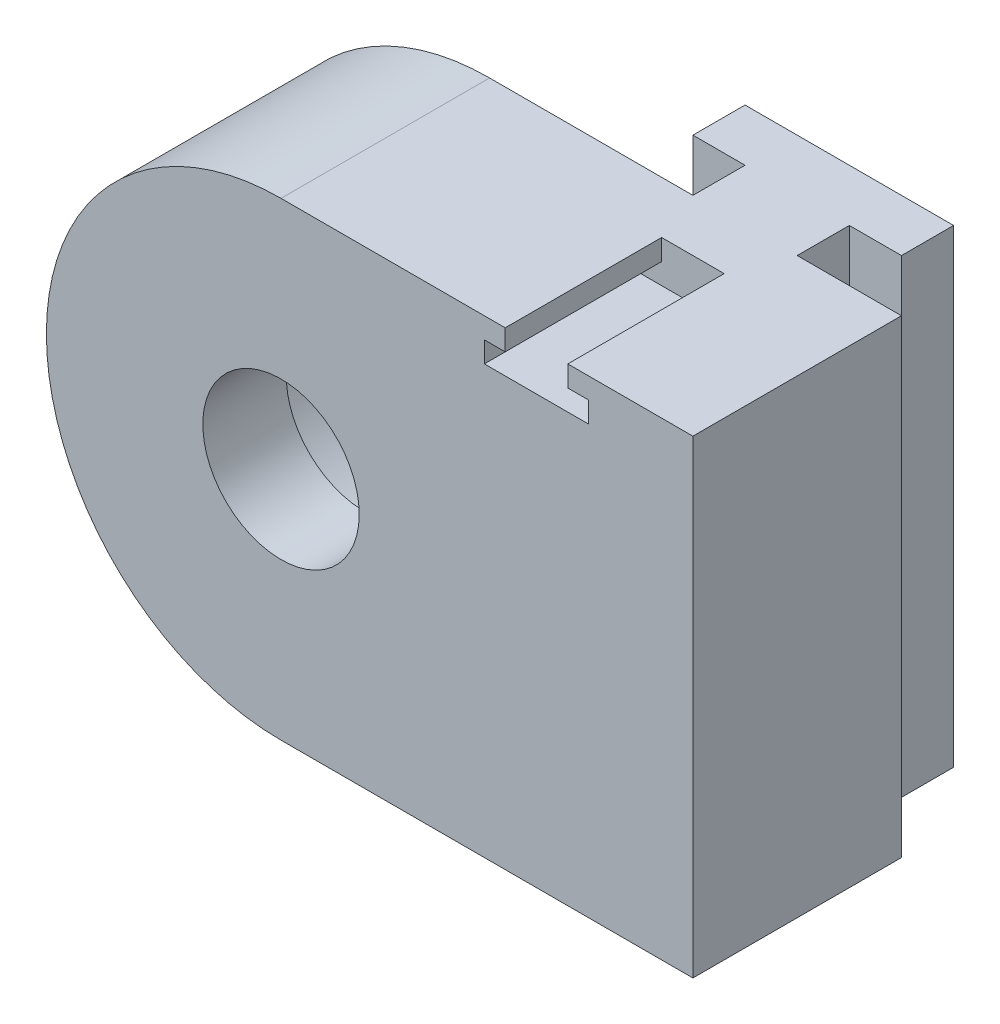
ISO-10303-21;
HEADER;
FILE_DESCRIPTION(('STEP AP214'),'2;1');
FILE_NAME('part.step','',(''),(''),'','','');
FILE_SCHEMA(('AUTOMOTIVE_DESIGN { 1 0 10303 214 1 1 1 1 }'));
ENDSEC;
DATA;
#1=APPLICATION_CONTEXT('core data for automotive mechanical design processes');
#2=APPLICATION_PROTOCOL_DEFINITION('international standard','automotive_design',2000,#1);
#3=PRODUCT_CONTEXT('',#1,'mechanical');
#4=PRODUCT('Part','Part','',(#3));
#5=PRODUCT_RELATED_PRODUCT_CATEGORY('part','',(#4));
#6=PRODUCT_DEFINITION_FORMATION('','',#4);
#7=PRODUCT_DEFINITION_CONTEXT('part definition',#1,'design');
#8=PRODUCT_DEFINITION('design','',#6,#7);
#9=PRODUCT_DEFINITION_SHAPE('','',#8);
#10=(LENGTH_UNIT() NAMED_UNIT(*) SI_UNIT(.MILLI.,.METRE.));
#11=(NAMED_UNIT(*) PLANE_ANGLE_UNIT() SI_UNIT($,.RADIAN.));
#12=(NAMED_UNIT(*) SI_UNIT($,.STERADIAN.) SOLID_ANGLE_UNIT());
#13=UNCERTAINTY_MEASURE_WITH_UNIT(LENGTH_MEASURE(1.E-05),#10,'distance_accuracy_value','');
#14=(GEOMETRIC_REPRESENTATION_CONTEXT(3) GLOBAL_UNCERTAINTY_ASSIGNED_CONTEXT((#13)) GLOBAL_UNIT_ASSIGNED_CONTEXT((#10,
#11,#12)) REPRESENTATION_CONTEXT('',''));
#15=CARTESIAN_POINT('',(0.,0.,0.));
#16=DIRECTION('',(0.,0.,1.));
#17=DIRECTION('',(1.,0.,0.));
#18=AXIS2_PLACEMENT_3D('',#15,#16,#17);
#19=CARTESIAN_POINT('',(-634.508066615171,-1.99999999999969,-10.));
#20=DIRECTION('',(0.,0.,1.));
#21=DIRECTION('',(1.,0.,0.));
#22=AXIS2_PLACEMENT_3D('',#19,#20,#21);
#23=PLANE('',#22);
#24=CARTESIAN_POINT('',(-634.508066615171,-1.99999999999969,-10.));
#25=DIRECTION('',(0.,0.,1.));
#26=DIRECTION('',(1.,0.,0.));
#27=AXIS2_PLACEMENT_3D('',#24,#25,#26);
#28=CIRCLE('',#27,14.);
#29=CARTESIAN_POINT('',(-620.508066615171,-1.99999999999969,-10.));
#30=VERTEX_POINT('',#29);
#31=EDGE_CURVE('E303',#30,#30,#28,.T.);
#32=ORIENTED_EDGE('',*,*,#31,.T.);
#33=EDGE_LOOP('',(#32));
#34=FACE_BOUND('',#33,.T.);
#35=DIRECTION('',(0.,1.,0.));
#36=VECTOR('',#35,1.);
#37=CARTESIAN_POINT('',(-615.008671928237,-24.5000000000001,-10.));
#38=LINE('',#37,#36);
#39=CARTESIAN_POINT('',(-615.008671928237,-24.5000000000001,-10.));
#40=VERTEX_POINT('',#39);
#41=CARTESIAN_POINT('',(-615.008671928237,20.4999999999999,-10.));
#42=VERTEX_POINT('',#41);
#43=EDGE_CURVE('E301',#40,#42,#38,.T.);
#44=ORIENTED_EDGE('',*,*,#43,.F.);
#45=DIRECTION('',(-1.,0.,0.));
#46=VECTOR('',#45,1.);
#47=CARTESIAN_POINT('',(-595.008671928237,-24.4999999999993,-10.));
#48=LINE('',#47,#46);
#49=CARTESIAN_POINT('',(-634.508066615171,-24.4999999999993,-10.));
#50=VERTEX_POINT('',#49);
#51=EDGE_CURVE('E344',#40,#50,#48,.T.);
#52=ORIENTED_EDGE('',*,*,#51,.T.);
#53=CARTESIAN_POINT('',(-634.508066615171,-1.99999999999969,-10.));
#54=DIRECTION('',(0.,0.,1.));
#55=DIRECTION('',(1.,0.,0.));
#56=AXIS2_PLACEMENT_3D('',#53,#54,#55);
#57=CIRCLE('',#56,22.4999999999996);
#58=CARTESIAN_POINT('',(-634.508066615171,20.4999999999999,-10.));
#59=VERTEX_POINT('',#58);
#60=EDGE_CURVE('E348',#59,#50,#57,.T.);
#61=ORIENTED_EDGE('',*,*,#60,.F.);
#62=DIRECTION('',(1.,0.,0.));
#63=VECTOR('',#62,1.);
#64=CARTESIAN_POINT('',(-634.508066615171,20.4999999999999,-10.));
#65=LINE('',#64,#63);
#66=EDGE_CURVE('E338',#59,#42,#65,.T.);
#67=ORIENTED_EDGE('',*,*,#66,.T.);
#68=EDGE_LOOP('',(#44,#52,#61,#67));
#69=FACE_BOUND('',#68,.T.);
#70=ADVANCED_FACE('F51',(#34,#69),#23,.F.);
#71=CARTESIAN_POINT('',(-634.508066615171,-1.99999999999969,10.));
#72=DIRECTION('',(0.,0.,1.));
#73=DIRECTION('',(1.,0.,0.));
#74=AXIS2_PLACEMENT_3D('',#71,#72,#73);
#75=PLANE('',#74);
#76=DIRECTION('',(0.,-1.,0.));
#77=VECTOR('',#76,1.);
#78=CARTESIAN_POINT('',(-613.008671928237,0.,10.));
#79=LINE('',#78,#77);
#80=CARTESIAN_POINT('',(-613.008671928237,20.4999999999999,10.));
#81=VERTEX_POINT('',#80);
#82=CARTESIAN_POINT('',(-613.008671928237,18.4999999999999,10.));
#83=VERTEX_POINT('',#82);
#84=EDGE_CURVE('E213',#81,#83,#79,.T.);
#85=ORIENTED_EDGE('',*,*,#84,.F.);
#86=DIRECTION('',(1.,0.,0.));
#87=VECTOR('',#86,1.);
#88=CARTESIAN_POINT('',(-634.508066615171,20.4999999999999,10.));
#89=LINE('',#88,#87);
#90=CARTESIAN_POINT('',(-634.508066615171,20.4999999999999,10.));
#91=VERTEX_POINT('',#90);
#92=EDGE_CURVE('E326',#91,#81,#89,.T.);
#93=ORIENTED_EDGE('',*,*,#92,.F.);
#94=CARTESIAN_POINT('',(-634.508066615171,-1.99999999999969,10.));
#95=DIRECTION('',(0.,0.,1.));
#96=DIRECTION('',(1.,0.,0.));
#97=AXIS2_PLACEMENT_3D('',#94,#95,#96);
#98=CIRCLE('',#97,22.4999999999996);
#99=CARTESIAN_POINT('',(-634.508066615171,-24.4999999999993,10.));
#100=VERTEX_POINT('',#99);
#101=EDGE_CURVE('E335',#91,#100,#98,.T.);
#102=ORIENTED_EDGE('',*,*,#101,.T.);
#103=DIRECTION('',(-1.,0.,0.));
#104=VECTOR('',#103,1.);
#105=CARTESIAN_POINT('',(-595.008671928237,-24.4999999999993,10.));
#106=LINE('',#105,#104);
#107=CARTESIAN_POINT('',(-595.008671928237,-24.4999999999993,10.));
#108=VERTEX_POINT('',#107);
#109=EDGE_CURVE('E332',#108,#100,#106,.T.);
#110=ORIENTED_EDGE('',*,*,#109,.F.);
#111=DIRECTION('',(0.,-1.,0.));
#112=VECTOR('',#111,1.);
#113=CARTESIAN_POINT('',(-595.008671928237,20.4999999999999,10.));
#114=LINE('',#113,#112);
#115=CARTESIAN_POINT('',(-595.008671928237,20.4999999999999,10.));
#116=VERTEX_POINT('',#115);
#117=EDGE_CURVE('E329',#116,#108,#114,.T.);
#118=ORIENTED_EDGE('',*,*,#117,.F.);
#119=CARTESIAN_POINT('',(-607.008671928237,20.4999999999999,10.));
#120=VERTEX_POINT('',#119);
#121=EDGE_CURVE('E212',#120,#116,#89,.T.);
#122=ORIENTED_EDGE('',*,*,#121,.F.);
#123=DIRECTION('',(0.,1.,0.));
#124=VECTOR('',#123,1.);
#125=CARTESIAN_POINT('',(-607.008671928237,0.,10.));
#126=LINE('',#125,#124);
#127=CARTESIAN_POINT('',(-607.008671928237,18.4999999999999,10.));
#128=VERTEX_POINT('',#127);
#129=EDGE_CURVE('E192',#128,#120,#126,.T.);
#130=ORIENTED_EDGE('',*,*,#129,.F.);
#131=DIRECTION('',(-1.,0.,0.));
#132=VECTOR('',#131,1.);
#133=CARTESIAN_POINT('',(0.,18.5000000000009,10.));
#134=LINE('',#133,#132);
#135=CARTESIAN_POINT('',(-605.008671928237,18.4999999999999,10.));
#136=VERTEX_POINT('',#135);
#137=EDGE_CURVE('E200',#136,#128,#134,.T.);
#138=ORIENTED_EDGE('',*,*,#137,.F.);
#139=DIRECTION('',(0.,1.,0.));
#140=VECTOR('',#139,1.);
#141=CARTESIAN_POINT('',(-605.008671928237,0.,10.));
#142=LINE('',#141,#140);
#143=CARTESIAN_POINT('',(-605.008671928237,16.4999999999999,10.));
#144=VERTEX_POINT('',#143);
#145=EDGE_CURVE('E227',#144,#136,#142,.T.);
#146=ORIENTED_EDGE('',*,*,#145,.F.);
#147=DIRECTION('',(1.,0.,0.));
#148=VECTOR('',#147,1.);
#149=CARTESIAN_POINT('',(0.,16.5000000000001,10.));
#150=LINE('',#149,#148);
#151=CARTESIAN_POINT('',(-615.008671928237,16.4999999999999,10.));
#152=VERTEX_POINT('',#151);
#153=EDGE_CURVE('E224',#152,#144,#150,.T.);
#154=ORIENTED_EDGE('',*,*,#153,.F.);
#155=DIRECTION('',(0.,-1.,0.));
#156=VECTOR('',#155,1.);
#157=CARTESIAN_POINT('',(-615.008671928237,0.,10.));
#158=LINE('',#157,#156);
#159=CARTESIAN_POINT('',(-615.008671928237,18.4999999999999,10.));
#160=VERTEX_POINT('',#159);
#161=EDGE_CURVE('E221',#160,#152,#158,.T.);
#162=ORIENTED_EDGE('',*,*,#161,.F.);
#163=DIRECTION('',(-1.,0.,0.));
#164=VECTOR('',#163,1.);
#165=CARTESIAN_POINT('',(0.,18.4999999999999,10.));
#166=LINE('',#165,#164);
#167=EDGE_CURVE('E216',#83,#160,#166,.T.);
#168=ORIENTED_EDGE('',*,*,#167,.F.);
#169=EDGE_LOOP('',(#85,#93,#102,#110,#118,#122,#130,#138,#146,#154,#162,#168));
#170=FACE_BOUND('',#169,.T.);
#171=CARTESIAN_POINT('',(-634.508066615171,-1.99999999999969,10.));
#172=DIRECTION('',(0.,0.,1.));
#173=DIRECTION('',(1.,0.,0.));
#174=AXIS2_PLACEMENT_3D('',#171,#172,#173);
#175=CIRCLE('',#174,7.49999999999996);
#176=CARTESIAN_POINT('',(-627.008066615171,-1.99999999999969,10.));
#177=VERTEX_POINT('',#176);
#178=EDGE_CURVE('E322',#177,#177,#175,.T.);
#179=ORIENTED_EDGE('',*,*,#178,.F.);
#180=EDGE_LOOP('',(#179));
#181=FACE_BOUND('',#180,.T.);
#182=ADVANCED_FACE('F209',(#170,#181),#75,.T.);
#183=CARTESIAN_POINT('',(-595.008671928237,-24.4999999999993,-10.));
#184=VERTEX_POINT('',#183);
#185=CARTESIAN_POINT('',(-605.008671928237,-24.5000000000001,-10.));
#186=VERTEX_POINT('',#185);
#187=EDGE_CURVE('E345',#184,#186,#48,.T.);
#188=ORIENTED_EDGE('',*,*,#187,.T.);
#189=DIRECTION('',(0.,1.,0.));
#190=VECTOR('',#189,1.);
#191=CARTESIAN_POINT('',(-605.008671928237,-24.5000000000001,-10.));
#192=LINE('',#191,#190);
#193=CARTESIAN_POINT('',(-605.008671928237,20.4999999999999,-10.));
#194=VERTEX_POINT('',#193);
#195=EDGE_CURVE('E282',#186,#194,#192,.T.);
#196=ORIENTED_EDGE('',*,*,#195,.T.);
#197=CARTESIAN_POINT('',(-595.008671928237,20.4999999999999,-10.));
#198=VERTEX_POINT('',#197);
#199=EDGE_CURVE('E325',#194,#198,#65,.T.);
#200=ORIENTED_EDGE('',*,*,#199,.T.);
#201=DIRECTION('',(0.,-1.,0.));
#202=VECTOR('',#201,1.);
#203=CARTESIAN_POINT('',(-595.008671928237,20.4999999999999,-10.));
#204=LINE('',#203,#202);
#205=EDGE_CURVE('E341',#198,#184,#204,.T.);
#206=ORIENTED_EDGE('',*,*,#205,.T.);
#207=EDGE_LOOP('',(#188,#196,#200,#206));
#208=FACE_BOUND('',#207,.T.);
#209=ADVANCED_FACE('F364',(#208),#23,.F.);
#210=CARTESIAN_POINT('',(-634.508066615171,20.4999999999999,10.));
#211=DIRECTION('',(0.,1.,0.));
#212=DIRECTION('',(0.,0.,1.));
#213=AXIS2_PLACEMENT_3D('',#210,#211,#212);
#214=PLANE('',#213);
#215=DIRECTION('',(0.,0.,1.));
#216=VECTOR('',#215,1.);
#217=CARTESIAN_POINT('',(-613.008671928237,20.4999999999999,-5.));
#218=LINE('',#217,#216);
#219=CARTESIAN_POINT('',(-613.008671928237,20.4999999999999,-5.));
#220=VERTEX_POINT('',#219);
#221=EDGE_CURVE('E258',#220,#81,#218,.T.);
#222=ORIENTED_EDGE('',*,*,#221,.F.);
#223=DIRECTION('',(1.,0.,0.));
#224=VECTOR('',#223,1.);
#225=CARTESIAN_POINT('',(0.,20.4999999999999,-5.));
#226=LINE('',#225,#224);
#227=CARTESIAN_POINT('',(-607.008671928237,20.4999999999999,-5.));
#228=VERTEX_POINT('',#227);
#229=EDGE_CURVE('E232',#220,#228,#226,.T.);
#230=ORIENTED_EDGE('',*,*,#229,.T.);
#231=DIRECTION('',(0.,0.,1.));
#232=VECTOR('',#231,1.);
#233=CARTESIAN_POINT('',(-607.008671928237,20.4999999999999,-5.));
#234=LINE('',#233,#232);
#235=EDGE_CURVE('E196',#228,#120,#234,.T.);
#236=ORIENTED_EDGE('',*,*,#235,.T.);
#237=ORIENTED_EDGE('',*,*,#121,.T.);
#238=DIRECTION('',(0.,0.,-1.));
#239=VECTOR('',#238,1.);
#240=CARTESIAN_POINT('',(-595.008671928237,20.4999999999999,10.));
#241=LINE('',#240,#239);
#242=EDGE_CURVE('E337',#116,#198,#241,.T.);
#243=ORIENTED_EDGE('',*,*,#242,.T.);
#244=ORIENTED_EDGE('',*,*,#199,.F.);
#245=DIRECTION('',(0.,0.,-1.));
#246=VECTOR('',#245,1.);
#247=CARTESIAN_POINT('',(-605.008671928237,20.4999999999999,-10.));
#248=LINE('',#247,#246);
#249=CARTESIAN_POINT('',(-605.008671928237,20.4999999999999,-15.));
#250=VERTEX_POINT('',#249);
#251=EDGE_CURVE('E76',#194,#250,#248,.T.);
#252=ORIENTED_EDGE('',*,*,#251,.T.);
#253=DIRECTION('',(1.,0.,0.));
#254=VECTOR('',#253,1.);
#255=CARTESIAN_POINT('',(-605.008671928237,20.4999999999999,-15.));
#256=LINE('',#255,#254);
#257=CARTESIAN_POINT('',(-600.008671928237,20.4999999999999,-15.));
#258=VERTEX_POINT('',#257);
#259=EDGE_CURVE('E284',#250,#258,#256,.T.);
#260=ORIENTED_EDGE('',*,*,#259,.T.);
#261=DIRECTION('',(0.,0.,-1.));
#262=VECTOR('',#261,1.);
#263=CARTESIAN_POINT('',(-600.008671928237,20.4999999999999,-15.));
#264=LINE('',#263,#262);
#265=CARTESIAN_POINT('',(-600.008671928237,20.4999999999999,-20.));
#266=VERTEX_POINT('',#265);
#267=EDGE_CURVE('E287',#258,#266,#264,.T.);
#268=ORIENTED_EDGE('',*,*,#267,.T.);
#269=DIRECTION('',(-1.,0.,0.));
#270=VECTOR('',#269,1.);
#271=CARTESIAN_POINT('',(-600.008671928237,20.4999999999999,-20.));
#272=LINE('',#271,#270);
#273=CARTESIAN_POINT('',(-620.008671928237,20.4999999999999,-20.));
#274=VERTEX_POINT('',#273);
#275=EDGE_CURVE('E290',#266,#274,#272,.T.);
#276=ORIENTED_EDGE('',*,*,#275,.T.);
#277=DIRECTION('',(0.,0.,1.));
#278=VECTOR('',#277,1.);
#279=CARTESIAN_POINT('',(-620.008671928237,20.4999999999999,-20.));
#280=LINE('',#279,#278);
#281=CARTESIAN_POINT('',(-620.008671928237,20.4999999999999,-15.));
#282=VERTEX_POINT('',#281);
#283=EDGE_CURVE('E293',#274,#282,#280,.T.);
#284=ORIENTED_EDGE('',*,*,#283,.T.);
#285=DIRECTION('',(1.,0.,0.));
#286=VECTOR('',#285,1.);
#287=CARTESIAN_POINT('',(-620.008671928237,20.4999999999999,-15.));
#288=LINE('',#287,#286);
#289=CARTESIAN_POINT('',(-615.008671928237,20.4999999999999,-15.));
#290=VERTEX_POINT('',#289);
#291=EDGE_CURVE('E296',#282,#290,#288,.T.);
#292=ORIENTED_EDGE('',*,*,#291,.T.);
#293=DIRECTION('',(0.,0.,1.));
#294=VECTOR('',#293,1.);
#295=CARTESIAN_POINT('',(-615.008671928237,20.4999999999999,-15.));
#296=LINE('',#295,#294);
#297=EDGE_CURVE('E265',#290,#42,#296,.T.);
#298=ORIENTED_EDGE('',*,*,#297,.T.);
#299=ORIENTED_EDGE('',*,*,#66,.F.);
#300=DIRECTION('',(0.,0.,-1.));
#301=VECTOR('',#300,1.);
#302=CARTESIAN_POINT('',(-634.508066615171,20.4999999999999,10.));
#303=LINE('',#302,#301);
#304=EDGE_CURVE('E12',#91,#59,#303,.T.);
#305=ORIENTED_EDGE('',*,*,#304,.F.);
#306=ORIENTED_EDGE('',*,*,#92,.T.);
#307=EDGE_LOOP('',(#222,#230,#236,#237,#243,#244,#252,#260,#268,#276,#284,#292,#298,#299,#305,#306));
#308=FACE_BOUND('',#307,.T.);
#309=ADVANCED_FACE('F53',(#308),#214,.T.);
#310=CARTESIAN_POINT('',(-634.508066615171,-1.99999999999969,10.));
#311=DIRECTION('',(0.,0.,-1.));
#312=DIRECTION('',(-1.,0.,0.));
#313=AXIS2_PLACEMENT_3D('',#310,#311,#312);
#314=CYLINDRICAL_SURFACE('',#313,22.4999999999996);
#315=ORIENTED_EDGE('',*,*,#60,.T.);
#316=DIRECTION('',(0.,0.,-1.));
#317=VECTOR('',#316,1.);
#318=CARTESIAN_POINT('',(-634.508066615171,-24.4999999999993,10.));
#319=LINE('',#318,#317);
#320=EDGE_CURVE('E60',#100,#50,#319,.T.);
#321=ORIENTED_EDGE('',*,*,#320,.F.);
#322=ORIENTED_EDGE('',*,*,#101,.F.);
#323=ORIENTED_EDGE('',*,*,#304,.T.);
#324=EDGE_LOOP('',(#315,#321,#322,#323));
#325=FACE_BOUND('',#324,.T.);
#326=ADVANCED_FACE('F401',(#325),#314,.T.);
#327=CARTESIAN_POINT('',(-595.008671928237,-24.4999999999993,10.));
#328=DIRECTION('',(0.,-1.,0.));
#329=DIRECTION('',(1.,0.,0.));
#330=AXIS2_PLACEMENT_3D('',#327,#328,#329);
#331=PLANE('',#330);
#332=ORIENTED_EDGE('',*,*,#187,.F.);
#333=DIRECTION('',(0.,0.,-1.));
#334=VECTOR('',#333,1.);
#335=CARTESIAN_POINT('',(-595.008671928237,-24.4999999999993,10.));
#336=LINE('',#335,#334);
#337=EDGE_CURVE('E353',#108,#184,#336,.T.);
#338=ORIENTED_EDGE('',*,*,#337,.F.);
#339=ORIENTED_EDGE('',*,*,#109,.T.);
#340=ORIENTED_EDGE('',*,*,#320,.T.);
#341=ORIENTED_EDGE('',*,*,#51,.F.);
#342=DIRECTION('',(0.,0.,1.));
#343=VECTOR('',#342,1.);
#344=CARTESIAN_POINT('',(-615.008671928237,-24.5000000000001,-15.));
#345=LINE('',#344,#343);
#346=CARTESIAN_POINT('',(-615.008671928237,-24.5000000000001,-15.));
#347=VERTEX_POINT('',#346);
#348=EDGE_CURVE('E280',#347,#40,#345,.T.);
#349=ORIENTED_EDGE('',*,*,#348,.F.);
#350=DIRECTION('',(1.,0.,0.));
#351=VECTOR('',#350,1.);
#352=CARTESIAN_POINT('',(-620.008671928237,-24.5000000000001,-15.));
#353=LINE('',#352,#351);
#354=CARTESIAN_POINT('',(-620.008671928237,-24.5000000000001,-15.));
#355=VERTEX_POINT('',#354);
#356=EDGE_CURVE('E277',#355,#347,#353,.T.);
#357=ORIENTED_EDGE('',*,*,#356,.F.);
#358=DIRECTION('',(0.,0.,1.));
#359=VECTOR('',#358,1.);
#360=CARTESIAN_POINT('',(-620.008671928237,-24.5000000000001,-20.));
#361=LINE('',#360,#359);
#362=CARTESIAN_POINT('',(-620.008671928237,-24.5000000000001,-20.));
#363=VERTEX_POINT('',#362);
#364=EDGE_CURVE('E274',#363,#355,#361,.T.);
#365=ORIENTED_EDGE('',*,*,#364,.F.);
#366=DIRECTION('',(-1.,0.,0.));
#367=VECTOR('',#366,1.);
#368=CARTESIAN_POINT('',(-600.008671928237,-24.5000000000001,-20.));
#369=LINE('',#368,#367);
#370=CARTESIAN_POINT('',(-600.008671928237,-24.5000000000001,-20.));
#371=VERTEX_POINT('',#370);
#372=EDGE_CURVE('E271',#371,#363,#369,.T.);
#373=ORIENTED_EDGE('',*,*,#372,.F.);
#374=DIRECTION('',(0.,0.,-1.));
#375=VECTOR('',#374,1.);
#376=CARTESIAN_POINT('',(-600.008671928237,-24.5000000000001,-15.));
#377=LINE('',#376,#375);
#378=CARTESIAN_POINT('',(-600.008671928237,-24.5000000000001,-15.));
#379=VERTEX_POINT('',#378);
#380=EDGE_CURVE('E268',#379,#371,#377,.T.);
#381=ORIENTED_EDGE('',*,*,#380,.F.);
#382=DIRECTION('',(1.,0.,0.));
#383=VECTOR('',#382,1.);
#384=CARTESIAN_POINT('',(-605.008671928237,-24.5000000000001,-15.));
#385=LINE('',#384,#383);
#386=CARTESIAN_POINT('',(-605.008671928237,-24.5000000000001,-15.));
#387=VERTEX_POINT('',#386);
#388=EDGE_CURVE('E264',#387,#379,#385,.T.);
#389=ORIENTED_EDGE('',*,*,#388,.F.);
#390=DIRECTION('',(0.,0.,-1.));
#391=VECTOR('',#390,1.);
#392=CARTESIAN_POINT('',(-605.008671928237,-24.5000000000001,-10.));
#393=LINE('',#392,#391);
#394=EDGE_CURVE('E261',#186,#387,#393,.T.);
#395=ORIENTED_EDGE('',*,*,#394,.F.);
#396=EDGE_LOOP('',(#332,#338,#339,#340,#341,#349,#357,#365,#373,#381,#389,#395));
#397=FACE_BOUND('',#396,.T.);
#398=ADVANCED_FACE('F369',(#397),#331,.T.);
#399=CARTESIAN_POINT('',(-595.008671928237,20.4999999999999,10.));
#400=DIRECTION('',(1.,0.,0.));
#401=DIRECTION('',(0.,0.,-1.));
#402=AXIS2_PLACEMENT_3D('',#399,#400,#401);
#403=PLANE('',#402);
#404=ORIENTED_EDGE('',*,*,#205,.F.);
#405=ORIENTED_EDGE('',*,*,#242,.F.);
#406=ORIENTED_EDGE('',*,*,#117,.T.);
#407=ORIENTED_EDGE('',*,*,#337,.T.);
#408=EDGE_LOOP('',(#404,#405,#406,#407));
#409=FACE_BOUND('',#408,.T.);
#410=ADVANCED_FACE('F361',(#409),#403,.T.);
#411=CARTESIAN_POINT('',(-634.508066615171,-1.99999999999969,10.));
#412=DIRECTION('',(0.,0.,-1.));
#413=DIRECTION('',(-1.,0.,0.));
#414=AXIS2_PLACEMENT_3D('',#411,#412,#413);
#415=CYLINDRICAL_SURFACE('',#414,7.49999999999996);
#416=CARTESIAN_POINT('',(-634.508066615171,-1.99999999999969,2.));
#417=DIRECTION('',(0.,0.,1.));
#418=DIRECTION('',(1.,0.,0.));
#419=AXIS2_PLACEMENT_3D('',#416,#417,#418);
#420=CIRCLE('',#419,7.49999999999996);
#421=CARTESIAN_POINT('',(-627.008066615171,-1.99999999999969,2.));
#422=VERTEX_POINT('',#421);
#423=EDGE_CURVE('E55',#422,#422,#420,.T.);
#424=ORIENTED_EDGE('',*,*,#423,.F.);
#425=EDGE_LOOP('',(#424));
#426=FACE_BOUND('',#425,.T.);
#427=ORIENTED_EDGE('',*,*,#178,.T.);
#428=EDGE_LOOP('',(#427));
#429=FACE_BOUND('',#428,.T.);
#430=ADVANCED_FACE('F451',(#426,#429),#415,.F.);
#431=CARTESIAN_POINT('',(-634.508066615171,-1.99999999999969,2.));
#432=DIRECTION('',(0.,0.,-1.));
#433=DIRECTION('',(-1.,0.,0.));
#434=AXIS2_PLACEMENT_3D('',#431,#432,#433);
#435=CYLINDRICAL_SURFACE('',#434,14.);
#436=CARTESIAN_POINT('',(-634.508066615171,-1.99999999999969,2.));
#437=DIRECTION('',(0.,0.,1.));
#438=DIRECTION('',(1.,0.,0.));
#439=AXIS2_PLACEMENT_3D('',#436,#437,#438);
#440=CIRCLE('',#439,14.);
#441=CARTESIAN_POINT('',(-620.508066615171,-1.99999999999969,2.));
#442=VERTEX_POINT('',#441);
#443=EDGE_CURVE('E319',#442,#442,#440,.T.);
#444=ORIENTED_EDGE('',*,*,#443,.T.);
#445=EDGE_LOOP('',(#444));
#446=FACE_BOUND('',#445,.T.);
#447=ORIENTED_EDGE('',*,*,#31,.F.);
#448=EDGE_LOOP('',(#447));
#449=FACE_BOUND('',#448,.T.);
#450=ADVANCED_FACE('F455',(#446,#449),#435,.F.);
#451=CARTESIAN_POINT('',(-634.508066615171,-1.99999999999969,2.));
#452=DIRECTION('',(0.,0.,1.));
#453=DIRECTION('',(1.,0.,0.));
#454=AXIS2_PLACEMENT_3D('',#451,#452,#453);
#455=PLANE('',#454);
#456=ORIENTED_EDGE('',*,*,#423,.T.);
#457=EDGE_LOOP('',(#456));
#458=FACE_BOUND('',#457,.T.);
#459=ORIENTED_EDGE('',*,*,#443,.F.);
#460=EDGE_LOOP('',(#459));
#461=FACE_BOUND('',#460,.T.);
#462=ADVANCED_FACE('F461',(#458,#461),#455,.F.);
#463=CARTESIAN_POINT('',(-615.008671928237,-24.5000000000001,-15.));
#464=DIRECTION('',(-1.,0.,0.));
#465=DIRECTION('',(0.,0.,1.));
#466=AXIS2_PLACEMENT_3D('',#463,#464,#465);
#467=PLANE('',#466);
#468=ORIENTED_EDGE('',*,*,#297,.F.);
#469=DIRECTION('',(0.,1.,0.));
#470=VECTOR('',#469,1.);
#471=CARTESIAN_POINT('',(-615.008671928237,-24.5000000000001,-15.));
#472=LINE('',#471,#470);
#473=EDGE_CURVE('E304',#347,#290,#472,.T.);
#474=ORIENTED_EDGE('',*,*,#473,.F.);
#475=ORIENTED_EDGE('',*,*,#348,.T.);
#476=ORIENTED_EDGE('',*,*,#43,.T.);
#477=EDGE_LOOP('',(#468,#474,#475,#476));
#478=FACE_BOUND('',#477,.T.);
#479=ADVANCED_FACE('F390',(#478),#467,.T.);
#480=CARTESIAN_POINT('',(-620.008671928237,-24.5000000000001,-15.));
#481=DIRECTION('',(0.,0.,1.));
#482=DIRECTION('',(1.,0.,0.));
#483=AXIS2_PLACEMENT_3D('',#480,#481,#482);
#484=PLANE('',#483);
#485=ORIENTED_EDGE('',*,*,#291,.F.);
#486=DIRECTION('',(0.,1.,0.));
#487=VECTOR('',#486,1.);
#488=CARTESIAN_POINT('',(-620.008671928237,-24.5000000000001,-15.));
#489=LINE('',#488,#487);
#490=EDGE_CURVE('E306',#355,#282,#489,.T.);
#491=ORIENTED_EDGE('',*,*,#490,.F.);
#492=ORIENTED_EDGE('',*,*,#356,.T.);
#493=ORIENTED_EDGE('',*,*,#473,.T.);
#494=EDGE_LOOP('',(#485,#491,#492,#493));
#495=FACE_BOUND('',#494,.T.);
#496=ADVANCED_FACE('F480',(#495),#484,.T.);
#497=CARTESIAN_POINT('',(-620.008671928237,-24.5000000000001,-20.));
#498=DIRECTION('',(-1.,0.,0.));
#499=DIRECTION('',(0.,0.,1.));
#500=AXIS2_PLACEMENT_3D('',#497,#498,#499);
#501=PLANE('',#500);
#502=ORIENTED_EDGE('',*,*,#283,.F.);
#503=DIRECTION('',(0.,1.,0.));
#504=VECTOR('',#503,1.);
#505=CARTESIAN_POINT('',(-620.008671928237,-24.5000000000001,-20.));
#506=LINE('',#505,#504);
#507=EDGE_CURVE('E308',#363,#274,#506,.T.);
#508=ORIENTED_EDGE('',*,*,#507,.F.);
#509=ORIENTED_EDGE('',*,*,#364,.T.);
#510=ORIENTED_EDGE('',*,*,#490,.T.);
#511=EDGE_LOOP('',(#502,#508,#509,#510));
#512=FACE_BOUND('',#511,.T.);
#513=ADVANCED_FACE('F384',(#512),#501,.T.);
#514=CARTESIAN_POINT('',(-600.008671928237,-24.5000000000001,-20.));
#515=DIRECTION('',(0.,0.,-1.));
#516=DIRECTION('',(-1.,0.,0.));
#517=AXIS2_PLACEMENT_3D('',#514,#515,#516);
#518=PLANE('',#517);
#519=ORIENTED_EDGE('',*,*,#275,.F.);
#520=DIRECTION('',(0.,1.,0.));
#521=VECTOR('',#520,1.);
#522=CARTESIAN_POINT('',(-600.008671928237,-24.5000000000001,-20.));
#523=LINE('',#522,#521);
#524=EDGE_CURVE('E310',#371,#266,#523,.T.);
#525=ORIENTED_EDGE('',*,*,#524,.F.);
#526=ORIENTED_EDGE('',*,*,#372,.T.);
#527=ORIENTED_EDGE('',*,*,#507,.T.);
#528=EDGE_LOOP('',(#519,#525,#526,#527));
#529=FACE_BOUND('',#528,.T.);
#530=ADVANCED_FACE('F380',(#529),#518,.T.);
#531=CARTESIAN_POINT('',(-600.008671928237,-24.5000000000001,-15.));
#532=DIRECTION('',(1.,0.,0.));
#533=DIRECTION('',(0.,0.,-1.));
#534=AXIS2_PLACEMENT_3D('',#531,#532,#533);
#535=PLANE('',#534);
#536=ORIENTED_EDGE('',*,*,#267,.F.);
#537=DIRECTION('',(0.,1.,0.));
#538=VECTOR('',#537,1.);
#539=CARTESIAN_POINT('',(-600.008671928237,-24.5000000000001,-15.));
#540=LINE('',#539,#538);
#541=EDGE_CURVE('E312',#379,#258,#540,.T.);
#542=ORIENTED_EDGE('',*,*,#541,.F.);
#543=ORIENTED_EDGE('',*,*,#380,.T.);
#544=ORIENTED_EDGE('',*,*,#524,.T.);
#545=EDGE_LOOP('',(#536,#542,#543,#544));
#546=FACE_BOUND('',#545,.T.);
#547=ADVANCED_FACE('F378',(#546),#535,.T.);
#548=CARTESIAN_POINT('',(-605.008671928237,-24.5000000000001,-15.));
#549=DIRECTION('',(0.,0.,1.));
#550=DIRECTION('',(1.,0.,0.));
#551=AXIS2_PLACEMENT_3D('',#548,#549,#550);
#552=PLANE('',#551);
#553=ORIENTED_EDGE('',*,*,#259,.F.);
#554=DIRECTION('',(0.,1.,0.));
#555=VECTOR('',#554,1.);
#556=CARTESIAN_POINT('',(-605.008671928237,-24.5000000000001,-15.));
#557=LINE('',#556,#555);
#558=EDGE_CURVE('E314',#387,#250,#557,.T.);
#559=ORIENTED_EDGE('',*,*,#558,.F.);
#560=ORIENTED_EDGE('',*,*,#388,.T.);
#561=ORIENTED_EDGE('',*,*,#541,.T.);
#562=EDGE_LOOP('',(#553,#559,#560,#561));
#563=FACE_BOUND('',#562,.T.);
#564=ADVANCED_FACE('F374',(#563),#552,.T.);
#565=CARTESIAN_POINT('',(-605.008671928237,-24.5000000000001,-10.));
#566=DIRECTION('',(1.,0.,0.));
#567=DIRECTION('',(0.,0.,-1.));
#568=AXIS2_PLACEMENT_3D('',#565,#566,#567);
#569=PLANE('',#568);
#570=ORIENTED_EDGE('',*,*,#251,.F.);
#571=ORIENTED_EDGE('',*,*,#195,.F.);
#572=ORIENTED_EDGE('',*,*,#394,.T.);
#573=ORIENTED_EDGE('',*,*,#558,.T.);
#574=EDGE_LOOP('',(#570,#571,#572,#573));
#575=FACE_BOUND('',#574,.T.);
#576=ADVANCED_FACE('F366',(#575),#569,.T.);
#577=CARTESIAN_POINT('',(0.,18.5000000000009,-5.));
#578=DIRECTION('',(0.,1.,0.));
#579=DIRECTION('',(-1.,0.,0.));
#580=AXIS2_PLACEMENT_3D('',#577,#578,#579);
#581=PLANE('',#580);
#582=DIRECTION('',(0.,0.,1.));
#583=VECTOR('',#582,1.);
#584=CARTESIAN_POINT('',(-607.008671928237,18.4999999999999,-5.));
#585=LINE('',#584,#583);
#586=CARTESIAN_POINT('',(-607.008671928237,18.4999999999999,-5.));
#587=VERTEX_POINT('',#586);
#588=EDGE_CURVE('E188',#587,#128,#585,.T.);
#589=ORIENTED_EDGE('',*,*,#588,.F.);
#590=DIRECTION('',(-1.,0.,0.));
#591=VECTOR('',#590,1.);
#592=CARTESIAN_POINT('',(0.,18.5000000000009,-5.));
#593=LINE('',#592,#591);
#594=CARTESIAN_POINT('',(-605.008671928237,18.4999999999999,-5.));
#595=VERTEX_POINT('',#594);
#596=EDGE_CURVE('E229',#595,#587,#593,.T.);
#597=ORIENTED_EDGE('',*,*,#596,.F.);
#598=DIRECTION('',(0.,0.,1.));
#599=VECTOR('',#598,1.);
#600=CARTESIAN_POINT('',(-605.008671928237,18.4999999999999,-5.));
#601=LINE('',#600,#599);
#602=EDGE_CURVE('E202',#595,#136,#601,.T.);
#603=ORIENTED_EDGE('',*,*,#602,.T.);
#604=ORIENTED_EDGE('',*,*,#137,.T.);
#605=EDGE_LOOP('',(#589,#597,#603,#604));
#606=FACE_BOUND('',#605,.T.);
#607=ADVANCED_FACE('F201',(#606),#581,.F.);
#608=CARTESIAN_POINT('',(-605.008671928237,0.,-5.));
#609=DIRECTION('',(1.,0.,0.));
#610=DIRECTION('',(0.,0.,-1.));
#611=AXIS2_PLACEMENT_3D('',#608,#609,#610);
#612=PLANE('',#611);
#613=ORIENTED_EDGE('',*,*,#602,.F.);
#614=DIRECTION('',(0.,1.,0.));
#615=VECTOR('',#614,1.);
#616=CARTESIAN_POINT('',(-605.008671928237,0.,-5.));
#617=LINE('',#616,#615);
#618=CARTESIAN_POINT('',(-605.008671928237,16.4999999999999,-5.));
#619=VERTEX_POINT('',#618);
#620=EDGE_CURVE('E197',#619,#595,#617,.T.);
#621=ORIENTED_EDGE('',*,*,#620,.F.);
#622=DIRECTION('',(0.,0.,1.));
#623=VECTOR('',#622,1.);
#624=CARTESIAN_POINT('',(-605.008671928237,16.4999999999999,-5.));
#625=LINE('',#624,#623);
#626=EDGE_CURVE('E250',#619,#144,#625,.T.);
#627=ORIENTED_EDGE('',*,*,#626,.T.);
#628=ORIENTED_EDGE('',*,*,#145,.T.);
#629=EDGE_LOOP('',(#613,#621,#627,#628));
#630=FACE_BOUND('',#629,.T.);
#631=ADVANCED_FACE('F421',(#630),#612,.F.);
#632=CARTESIAN_POINT('',(0.,16.5000000000001,-5.));
#633=DIRECTION('',(0.,-1.,0.));
#634=DIRECTION('',(1.,0.,0.));
#635=AXIS2_PLACEMENT_3D('',#632,#633,#634);
#636=PLANE('',#635);
#637=ORIENTED_EDGE('',*,*,#626,.F.);
#638=DIRECTION('',(1.,0.,0.));
#639=VECTOR('',#638,1.);
#640=CARTESIAN_POINT('',(0.,16.5000000000001,-5.));
#641=LINE('',#640,#639);
#642=CARTESIAN_POINT('',(-615.008671928237,16.4999999999999,-5.));
#643=VERTEX_POINT('',#642);
#644=EDGE_CURVE('E244',#643,#619,#641,.T.);
#645=ORIENTED_EDGE('',*,*,#644,.F.);
#646=DIRECTION('',(0.,0.,1.));
#647=VECTOR('',#646,1.);
#648=CARTESIAN_POINT('',(-615.008671928237,16.4999999999999,-5.));
#649=LINE('',#648,#647);
#650=EDGE_CURVE('E252',#643,#152,#649,.T.);
#651=ORIENTED_EDGE('',*,*,#650,.T.);
#652=ORIENTED_EDGE('',*,*,#153,.T.);
#653=EDGE_LOOP('',(#637,#645,#651,#652));
#654=FACE_BOUND('',#653,.T.);
#655=ADVANCED_FACE('F418',(#654),#636,.F.);
#656=CARTESIAN_POINT('',(-615.008671928237,0.,-5.));
#657=DIRECTION('',(-1.,0.,0.));
#658=DIRECTION('',(0.,0.,1.));
#659=AXIS2_PLACEMENT_3D('',#656,#657,#658);
#660=PLANE('',#659);
#661=ORIENTED_EDGE('',*,*,#650,.F.);
#662=DIRECTION('',(0.,-1.,0.));
#663=VECTOR('',#662,1.);
#664=CARTESIAN_POINT('',(-615.008671928237,0.,-5.));
#665=LINE('',#664,#663);
#666=CARTESIAN_POINT('',(-615.008671928237,18.4999999999999,-5.));
#667=VERTEX_POINT('',#666);
#668=EDGE_CURVE('E241',#667,#643,#665,.T.);
#669=ORIENTED_EDGE('',*,*,#668,.F.);
#670=DIRECTION('',(0.,0.,1.));
#671=VECTOR('',#670,1.);
#672=CARTESIAN_POINT('',(-615.008671928237,18.4999999999999,-5.));
#673=LINE('',#672,#671);
#674=EDGE_CURVE('E254',#667,#160,#673,.T.);
#675=ORIENTED_EDGE('',*,*,#674,.T.);
#676=ORIENTED_EDGE('',*,*,#161,.T.);
#677=EDGE_LOOP('',(#661,#669,#675,#676));
#678=FACE_BOUND('',#677,.T.);
#679=ADVANCED_FACE('F414',(#678),#660,.F.);
#680=CARTESIAN_POINT('',(0.,18.4999999999999,-5.));
#681=DIRECTION('',(0.,1.,0.));
#682=DIRECTION('',(0.,0.,1.));
#683=AXIS2_PLACEMENT_3D('',#680,#681,#682);
#684=PLANE('',#683);
#685=ORIENTED_EDGE('',*,*,#674,.F.);
#686=DIRECTION('',(-1.,0.,0.));
#687=VECTOR('',#686,1.);
#688=CARTESIAN_POINT('',(0.,18.4999999999999,-5.));
#689=LINE('',#688,#687);
#690=CARTESIAN_POINT('',(-613.008671928237,18.4999999999999,-5.));
#691=VERTEX_POINT('',#690);
#692=EDGE_CURVE('E238',#691,#667,#689,.T.);
#693=ORIENTED_EDGE('',*,*,#692,.F.);
#694=DIRECTION('',(0.,0.,1.));
#695=VECTOR('',#694,1.);
#696=CARTESIAN_POINT('',(-613.008671928237,18.4999999999999,-5.));
#697=LINE('',#696,#695);
#698=EDGE_CURVE('E256',#691,#83,#697,.T.);
#699=ORIENTED_EDGE('',*,*,#698,.T.);
#700=ORIENTED_EDGE('',*,*,#167,.T.);
#701=EDGE_LOOP('',(#685,#693,#699,#700));
#702=FACE_BOUND('',#701,.T.);
#703=ADVANCED_FACE('F412',(#702),#684,.F.);
#704=CARTESIAN_POINT('',(-613.008671928237,0.,-5.));
#705=DIRECTION('',(-1.,0.,0.));
#706=DIRECTION('',(0.,0.,1.));
#707=AXIS2_PLACEMENT_3D('',#704,#705,#706);
#708=PLANE('',#707);
#709=ORIENTED_EDGE('',*,*,#698,.F.);
#710=DIRECTION('',(0.,-1.,0.));
#711=VECTOR('',#710,1.);
#712=CARTESIAN_POINT('',(-613.008671928237,0.,-5.));
#713=LINE('',#712,#711);
#714=EDGE_CURVE('E235',#220,#691,#713,.T.);
#715=ORIENTED_EDGE('',*,*,#714,.F.);
#716=ORIENTED_EDGE('',*,*,#221,.T.);
#717=ORIENTED_EDGE('',*,*,#84,.T.);
#718=EDGE_LOOP('',(#709,#715,#716,#717));
#719=FACE_BOUND('',#718,.T.);
#720=ADVANCED_FACE('F406',(#719),#708,.F.);
#721=CARTESIAN_POINT('',(-607.008671928237,0.,-5.));
#722=DIRECTION('',(1.,0.,0.));
#723=DIRECTION('',(0.,0.,-1.));
#724=AXIS2_PLACEMENT_3D('',#721,#722,#723);
#725=PLANE('',#724);
#726=ORIENTED_EDGE('',*,*,#235,.F.);
#727=DIRECTION('',(0.,1.,0.));
#728=VECTOR('',#727,1.);
#729=CARTESIAN_POINT('',(-607.008671928237,0.,-5.));
#730=LINE('',#729,#728);
#731=EDGE_CURVE('E68',#587,#228,#730,.T.);
#732=ORIENTED_EDGE('',*,*,#731,.F.);
#733=ORIENTED_EDGE('',*,*,#588,.T.);
#734=ORIENTED_EDGE('',*,*,#129,.T.);
#735=EDGE_LOOP('',(#726,#732,#733,#734));
#736=FACE_BOUND('',#735,.T.);
#737=ADVANCED_FACE('F190',(#736),#725,.F.);
#738=CARTESIAN_POINT('',(0.,0.,-5.));
#739=DIRECTION('',(0.,0.,1.));
#740=DIRECTION('',(1.,0.,0.));
#741=AXIS2_PLACEMENT_3D('',#738,#739,#740);
#742=PLANE('',#741);
#743=ORIENTED_EDGE('',*,*,#596,.T.);
#744=ORIENTED_EDGE('',*,*,#731,.T.);
#745=ORIENTED_EDGE('',*,*,#229,.F.);
#746=ORIENTED_EDGE('',*,*,#714,.T.);
#747=ORIENTED_EDGE('',*,*,#692,.T.);
#748=ORIENTED_EDGE('',*,*,#668,.T.);
#749=ORIENTED_EDGE('',*,*,#644,.T.);
#750=ORIENTED_EDGE('',*,*,#620,.T.);
#751=EDGE_LOOP('',(#743,#744,#745,#746,#747,#748,#749,#750));
#752=FACE_BOUND('',#751,.T.);
#753=ADVANCED_FACE('F409',(#752),#742,.T.);
#754=CLOSED_SHELL('',(#70,#182,#209,#309,#326,#398,#410,#430,#450,#462,#479,#496,#513,#530,#547,
#564,#576,#607,#631,#655,#679,#703,#720,#737,#753));
#755=MANIFOLD_SOLID_BREP('B2',#754);
#756=ADVANCED_BREP_SHAPE_REPRESENTATION('',(#18,#755),#14);
#757=SHAPE_DEFINITION_REPRESENTATION(#9,#756);
ENDSEC;
END-ISO-10303-21;
